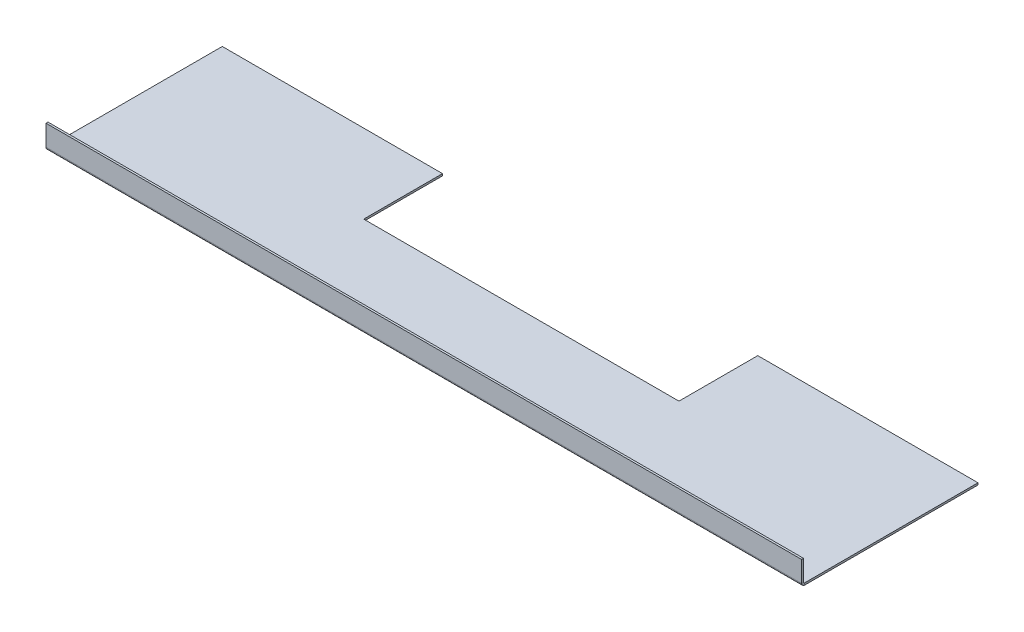
ISO-10303-21;
HEADER;
FILE_DESCRIPTION(('STEP AP214'),'2;1');
FILE_NAME('part.step','',(''),(''),'','','');
FILE_SCHEMA(('AUTOMOTIVE_DESIGN { 1 0 10303 214 1 1 1 1 }'));
ENDSEC;
DATA;
#1=APPLICATION_CONTEXT('core data for automotive mechanical design processes');
#2=APPLICATION_PROTOCOL_DEFINITION('international standard','automotive_design',2000,#1);
#3=PRODUCT_CONTEXT('',#1,'mechanical');
#4=PRODUCT('Part','Part','',(#3));
#5=PRODUCT_RELATED_PRODUCT_CATEGORY('part','',(#4));
#6=PRODUCT_DEFINITION_FORMATION('','',#4);
#7=PRODUCT_DEFINITION_CONTEXT('part definition',#1,'design');
#8=PRODUCT_DEFINITION('design','',#6,#7);
#9=PRODUCT_DEFINITION_SHAPE('','',#8);
#10=(LENGTH_UNIT() NAMED_UNIT(*) SI_UNIT(.MILLI.,.METRE.));
#11=(NAMED_UNIT(*) PLANE_ANGLE_UNIT() SI_UNIT($,.RADIAN.));
#12=(NAMED_UNIT(*) SI_UNIT($,.STERADIAN.) SOLID_ANGLE_UNIT());
#13=UNCERTAINTY_MEASURE_WITH_UNIT(LENGTH_MEASURE(1.E-05),#10,'distance_accuracy_value','');
#14=(GEOMETRIC_REPRESENTATION_CONTEXT(3) GLOBAL_UNCERTAINTY_ASSIGNED_CONTEXT((#13)) GLOBAL_UNIT_ASSIGNED_CONTEXT((#10,
#11,#12)) REPRESENTATION_CONTEXT('',''));
#15=CARTESIAN_POINT('',(0.,0.,0.));
#16=DIRECTION('',(0.,0.,1.));
#17=DIRECTION('',(1.,0.,0.));
#18=AXIS2_PLACEMENT_3D('',#15,#16,#17);
#19=CARTESIAN_POINT('',(304.419,-1.5875,-69.85));
#20=DIRECTION('',(1.,0.,0.));
#21=DIRECTION('',(0.,0.,-1.));
#22=AXIS2_PLACEMENT_3D('',#19,#20,#21);
#23=PLANE('',#22);
#24=DIRECTION('',(0.,0.,-1.));
#25=VECTOR('',#24,1.);
#26=CARTESIAN_POINT('',(304.419,0.,-69.85));
#27=LINE('',#26,#25);
#28=CARTESIAN_POINT('',(304.419,0.,69.85));
#29=VERTEX_POINT('',#28);
#30=CARTESIAN_POINT('',(304.419,0.,-69.85));
#31=VERTEX_POINT('',#30);
#32=EDGE_CURVE('E112',#29,#31,#27,.T.);
#33=ORIENTED_EDGE('',*,*,#32,.F.);
#34=DIRECTION('',(0.,1.,0.));
#35=VECTOR('',#34,1.);
#36=CARTESIAN_POINT('',(304.419,-1.5875,69.85));
#37=LINE('',#36,#35);
#38=CARTESIAN_POINT('',(304.419,-1.58749999999999,69.85));
#39=VERTEX_POINT('',#38);
#40=EDGE_CURVE('E13',#39,#29,#37,.T.);
#41=ORIENTED_EDGE('',*,*,#40,.F.);
#42=DIRECTION('',(0.,0.,-1.));
#43=VECTOR('',#42,1.);
#44=CARTESIAN_POINT('',(304.419,-1.5875,-69.85));
#45=LINE('',#44,#43);
#46=CARTESIAN_POINT('',(304.419,-1.5875,-69.85));
#47=VERTEX_POINT('',#46);
#48=EDGE_CURVE('E185',#39,#47,#45,.T.);
#49=ORIENTED_EDGE('',*,*,#48,.T.);
#50=DIRECTION('',(0.,1.,0.));
#51=VECTOR('',#50,1.);
#52=CARTESIAN_POINT('',(304.419,-1.5875,-69.85));
#53=LINE('',#52,#51);
#54=EDGE_CURVE('E64',#47,#31,#53,.T.);
#55=ORIENTED_EDGE('',*,*,#54,.T.);
#56=EDGE_LOOP('',(#33,#41,#49,#55));
#57=FACE_BOUND('',#56,.T.);
#58=ADVANCED_FACE('F61',(#57),#23,.T.);
#59=CARTESIAN_POINT('',(-304.419,-1.5875,-69.85));
#60=DIRECTION('',(-1.,0.,0.));
#61=DIRECTION('',(0.,0.,1.));
#62=AXIS2_PLACEMENT_3D('',#59,#60,#61);
#63=PLANE('',#62);
#64=DIRECTION('',(0.,0.,1.));
#65=VECTOR('',#64,1.);
#66=CARTESIAN_POINT('',(-304.419,0.,-69.85));
#67=LINE('',#66,#65);
#68=CARTESIAN_POINT('',(-304.419,0.,-69.85));
#69=VERTEX_POINT('',#68);
#70=CARTESIAN_POINT('',(-304.419,0.,69.85));
#71=VERTEX_POINT('',#70);
#72=EDGE_CURVE('E182',#69,#71,#67,.T.);
#73=ORIENTED_EDGE('',*,*,#72,.F.);
#74=DIRECTION('',(0.,1.,0.));
#75=VECTOR('',#74,1.);
#76=CARTESIAN_POINT('',(-304.419,-1.5875,-69.85));
#77=LINE('',#76,#75);
#78=CARTESIAN_POINT('',(-304.419,-1.5875,-69.85));
#79=VERTEX_POINT('',#78);
#80=EDGE_CURVE('E146',#79,#69,#77,.T.);
#81=ORIENTED_EDGE('',*,*,#80,.F.);
#82=DIRECTION('',(0.,0.,1.));
#83=VECTOR('',#82,1.);
#84=CARTESIAN_POINT('',(-304.419,-1.5875,-69.85));
#85=LINE('',#84,#83);
#86=CARTESIAN_POINT('',(-304.419,-1.5875,69.85));
#87=VERTEX_POINT('',#86);
#88=EDGE_CURVE('E79',#79,#87,#85,.T.);
#89=ORIENTED_EDGE('',*,*,#88,.T.);
#90=DIRECTION('',(0.,1.,0.));
#91=VECTOR('',#90,1.);
#92=CARTESIAN_POINT('',(-304.419,-1.5875,69.85));
#93=LINE('',#92,#91);
#94=EDGE_CURVE('E70',#87,#71,#93,.T.);
#95=ORIENTED_EDGE('',*,*,#94,.T.);
#96=EDGE_LOOP('',(#73,#81,#89,#95));
#97=FACE_BOUND('',#96,.T.);
#98=ADVANCED_FACE('F242',(#97),#63,.T.);
#99=CARTESIAN_POINT('',(-304.419,-1.5875,-69.85));
#100=DIRECTION('',(0.,0.,-1.));
#101=DIRECTION('',(-1.,0.,0.));
#102=AXIS2_PLACEMENT_3D('',#99,#100,#101);
#103=PLANE('',#102);
#104=DIRECTION('',(-1.,0.,0.));
#105=VECTOR('',#104,1.);
#106=CARTESIAN_POINT('',(-304.419,0.,-69.85));
#107=LINE('',#106,#105);
#108=CARTESIAN_POINT('',(-127.,0.,-69.85));
#109=VERTEX_POINT('',#108);
#110=EDGE_CURVE('E141',#109,#69,#107,.T.);
#111=ORIENTED_EDGE('',*,*,#110,.F.);
#112=DIRECTION('',(0.,1.,0.));
#113=VECTOR('',#112,1.);
#114=CARTESIAN_POINT('',(-127.,-1.5875,-69.85));
#115=LINE('',#114,#113);
#116=CARTESIAN_POINT('',(-127.,-1.5875,-69.85));
#117=VERTEX_POINT('',#116);
#118=EDGE_CURVE('E136',#117,#109,#115,.T.);
#119=ORIENTED_EDGE('',*,*,#118,.F.);
#120=DIRECTION('',(-1.,0.,0.));
#121=VECTOR('',#120,1.);
#122=CARTESIAN_POINT('',(-304.419,-1.5875,-69.85));
#123=LINE('',#122,#121);
#124=EDGE_CURVE('E139',#117,#79,#123,.T.);
#125=ORIENTED_EDGE('',*,*,#124,.T.);
#126=ORIENTED_EDGE('',*,*,#80,.T.);
#127=EDGE_LOOP('',(#111,#119,#125,#126));
#128=FACE_BOUND('',#127,.T.);
#129=ADVANCED_FACE('F138',(#128),#103,.T.);
#130=CARTESIAN_POINT('',(-127.,-1.5875,-69.85));
#131=DIRECTION('',(1.,0.,0.));
#132=DIRECTION('',(0.,0.,-1.));
#133=AXIS2_PLACEMENT_3D('',#130,#131,#132);
#134=PLANE('',#133);
#135=DIRECTION('',(0.,0.,-1.));
#136=VECTOR('',#135,1.);
#137=CARTESIAN_POINT('',(-127.,0.,-69.85));
#138=LINE('',#137,#136);
#139=CARTESIAN_POINT('',(-127.,0.,-6.35000000000004));
#140=VERTEX_POINT('',#139);
#141=EDGE_CURVE('E179',#140,#109,#138,.T.);
#142=ORIENTED_EDGE('',*,*,#141,.F.);
#143=DIRECTION('',(0.,1.,0.));
#144=VECTOR('',#143,1.);
#145=CARTESIAN_POINT('',(-127.,-1.5875,-6.35000000000004));
#146=LINE('',#145,#144);
#147=CARTESIAN_POINT('',(-127.,-1.5875,-6.35000000000004));
#148=VERTEX_POINT('',#147);
#149=EDGE_CURVE('E147',#148,#140,#146,.T.);
#150=ORIENTED_EDGE('',*,*,#149,.F.);
#151=DIRECTION('',(0.,0.,-1.));
#152=VECTOR('',#151,1.);
#153=CARTESIAN_POINT('',(-127.,-1.5875,-69.85));
#154=LINE('',#153,#152);
#155=EDGE_CURVE('E154',#148,#117,#154,.T.);
#156=ORIENTED_EDGE('',*,*,#155,.T.);
#157=ORIENTED_EDGE('',*,*,#118,.T.);
#158=EDGE_LOOP('',(#142,#150,#156,#157));
#159=FACE_BOUND('',#158,.T.);
#160=ADVANCED_FACE('F157',(#159),#134,.T.);
#161=CARTESIAN_POINT('',(-127.,-1.5875,-6.35000000000004));
#162=DIRECTION('',(0.,0.,-1.));
#163=DIRECTION('',(-1.,0.,0.));
#164=AXIS2_PLACEMENT_3D('',#161,#162,#163);
#165=PLANE('',#164);
#166=DIRECTION('',(-1.,0.,0.));
#167=VECTOR('',#166,1.);
#168=CARTESIAN_POINT('',(-127.,0.,-6.35000000000004));
#169=LINE('',#168,#167);
#170=CARTESIAN_POINT('',(127.,0.,-6.35000000000003));
#171=VERTEX_POINT('',#170);
#172=EDGE_CURVE('E176',#171,#140,#169,.T.);
#173=ORIENTED_EDGE('',*,*,#172,.F.);
#174=DIRECTION('',(0.,1.,0.));
#175=VECTOR('',#174,1.);
#176=CARTESIAN_POINT('',(127.,-1.5875,-6.35000000000003));
#177=LINE('',#176,#175);
#178=CARTESIAN_POINT('',(127.,-1.5875,-6.35000000000003));
#179=VERTEX_POINT('',#178);
#180=EDGE_CURVE('E190',#179,#171,#177,.T.);
#181=ORIENTED_EDGE('',*,*,#180,.F.);
#182=DIRECTION('',(-1.,0.,0.));
#183=VECTOR('',#182,1.);
#184=CARTESIAN_POINT('',(-127.,-1.5875,-6.35000000000004));
#185=LINE('',#184,#183);
#186=EDGE_CURVE('E158',#179,#148,#185,.T.);
#187=ORIENTED_EDGE('',*,*,#186,.T.);
#188=ORIENTED_EDGE('',*,*,#149,.T.);
#189=EDGE_LOOP('',(#173,#181,#187,#188));
#190=FACE_BOUND('',#189,.T.);
#191=ADVANCED_FACE('F232',(#190),#165,.T.);
#192=CARTESIAN_POINT('',(127.,-1.5875,-69.85));
#193=DIRECTION('',(-1.,0.,0.));
#194=DIRECTION('',(0.,0.,1.));
#195=AXIS2_PLACEMENT_3D('',#192,#193,#194);
#196=PLANE('',#195);
#197=DIRECTION('',(0.,0.,1.));
#198=VECTOR('',#197,1.);
#199=CARTESIAN_POINT('',(127.,0.,-69.85));
#200=LINE('',#199,#198);
#201=CARTESIAN_POINT('',(127.,0.,-69.85));
#202=VERTEX_POINT('',#201);
#203=EDGE_CURVE('E173',#202,#171,#200,.T.);
#204=ORIENTED_EDGE('',*,*,#203,.F.);
#205=DIRECTION('',(0.,1.,0.));
#206=VECTOR('',#205,1.);
#207=CARTESIAN_POINT('',(127.,-1.5875,-69.85));
#208=LINE('',#207,#206);
#209=CARTESIAN_POINT('',(127.,-1.5875,-69.85));
#210=VERTEX_POINT('',#209);
#211=EDGE_CURVE('E191',#210,#202,#208,.T.);
#212=ORIENTED_EDGE('',*,*,#211,.F.);
#213=DIRECTION('',(0.,0.,1.));
#214=VECTOR('',#213,1.);
#215=CARTESIAN_POINT('',(127.,-1.5875,-69.85));
#216=LINE('',#215,#214);
#217=EDGE_CURVE('E160',#210,#179,#216,.T.);
#218=ORIENTED_EDGE('',*,*,#217,.T.);
#219=ORIENTED_EDGE('',*,*,#180,.T.);
#220=EDGE_LOOP('',(#204,#212,#218,#219));
#221=FACE_BOUND('',#220,.T.);
#222=ADVANCED_FACE('F229',(#221),#196,.T.);
#223=CARTESIAN_POINT('',(127.,-1.5875,-69.85));
#224=DIRECTION('',(0.,0.,-1.));
#225=DIRECTION('',(-1.,0.,0.));
#226=AXIS2_PLACEMENT_3D('',#223,#224,#225);
#227=PLANE('',#226);
#228=DIRECTION('',(-1.,0.,0.));
#229=VECTOR('',#228,1.);
#230=CARTESIAN_POINT('',(127.,0.,-69.85));
#231=LINE('',#230,#229);
#232=EDGE_CURVE('E169',#31,#202,#231,.T.);
#233=ORIENTED_EDGE('',*,*,#232,.F.);
#234=ORIENTED_EDGE('',*,*,#54,.F.);
#235=DIRECTION('',(-1.,0.,0.));
#236=VECTOR('',#235,1.);
#237=CARTESIAN_POINT('',(127.,-1.5875,-69.85));
#238=LINE('',#237,#236);
#239=EDGE_CURVE('E225',#47,#210,#238,.T.);
#240=ORIENTED_EDGE('',*,*,#239,.T.);
#241=ORIENTED_EDGE('',*,*,#211,.T.);
#242=EDGE_LOOP('',(#233,#234,#240,#241));
#243=FACE_BOUND('',#242,.T.);
#244=ADVANCED_FACE('F194',(#243),#227,.T.);
#245=CARTESIAN_POINT('',(0.,-1.5875,0.));
#246=DIRECTION('',(0.,1.,0.));
#247=DIRECTION('',(0.,0.,1.));
#248=AXIS2_PLACEMENT_3D('',#245,#246,#247);
#249=PLANE('',#248);
#250=ORIENTED_EDGE('',*,*,#48,.F.);
#251=DIRECTION('',(1.,0.,0.));
#252=VECTOR('',#251,1.);
#253=CARTESIAN_POINT('',(-304.419,-1.5875,69.85));
#254=LINE('',#253,#252);
#255=EDGE_CURVE('E165',#87,#39,#254,.T.);
#256=ORIENTED_EDGE('',*,*,#255,.F.);
#257=ORIENTED_EDGE('',*,*,#88,.F.);
#258=ORIENTED_EDGE('',*,*,#124,.F.);
#259=ORIENTED_EDGE('',*,*,#155,.F.);
#260=ORIENTED_EDGE('',*,*,#186,.F.);
#261=ORIENTED_EDGE('',*,*,#217,.F.);
#262=ORIENTED_EDGE('',*,*,#239,.F.);
#263=EDGE_LOOP('',(#250,#256,#257,#258,#259,#260,#261,#262));
#264=FACE_BOUND('',#263,.T.);
#265=ADVANCED_FACE('F152',(#264),#249,.F.);
#266=CARTESIAN_POINT('',(0.,0.,0.));
#267=DIRECTION('',(0.,1.,0.));
#268=DIRECTION('',(0.,0.,1.));
#269=AXIS2_PLACEMENT_3D('',#266,#267,#268);
#270=PLANE('',#269);
#271=ORIENTED_EDGE('',*,*,#32,.T.);
#272=ORIENTED_EDGE('',*,*,#232,.T.);
#273=ORIENTED_EDGE('',*,*,#203,.T.);
#274=ORIENTED_EDGE('',*,*,#172,.T.);
#275=ORIENTED_EDGE('',*,*,#141,.T.);
#276=ORIENTED_EDGE('',*,*,#110,.T.);
#277=ORIENTED_EDGE('',*,*,#72,.T.);
#278=DIRECTION('',(1.,0.,0.));
#279=VECTOR('',#278,1.);
#280=CARTESIAN_POINT('',(-304.419,0.,69.85));
#281=LINE('',#280,#279);
#282=EDGE_CURVE('E184',#71,#29,#281,.T.);
#283=ORIENTED_EDGE('',*,*,#282,.T.);
#284=EDGE_LOOP('',(#271,#272,#273,#274,#275,#276,#277,#283));
#285=FACE_BOUND('',#284,.T.);
#286=ADVANCED_FACE('F196',(#285),#270,.T.);
#287=CARTESIAN_POINT('',(-304.419,0.736600000000011,69.85));
#288=DIRECTION('',(-1.,0.,0.));
#289=DIRECTION('',(0.,0.,1.));
#290=AXIS2_PLACEMENT_3D('',#287,#288,#289);
#291=PLANE('',#290);
#292=DIRECTION('',(0.,0.,-1.));
#293=VECTOR('',#292,1.);
#294=CARTESIAN_POINT('',(-304.419,0.736600000000004,72.1741));
#295=LINE('',#294,#293);
#296=CARTESIAN_POINT('',(-304.419,0.736600000000011,70.5866));
#297=VERTEX_POINT('',#296);
#298=CARTESIAN_POINT('',(-304.419,0.736600000000011,72.1741));
#299=VERTEX_POINT('',#298);
#300=EDGE_CURVE('E328',#297,#299,#295,.F.);
#301=ORIENTED_EDGE('',*,*,#300,.F.);
#302=CARTESIAN_POINT('',(-304.419,0.736600000000011,69.85));
#303=DIRECTION('',(1.,0.,0.));
#304=DIRECTION('',(0.,0.,-1.));
#305=AXIS2_PLACEMENT_3D('',#302,#303,#304);
#306=CIRCLE('',#305,0.736600000000004);
#307=EDGE_CURVE('E215',#71,#297,#306,.F.);
#308=ORIENTED_EDGE('',*,*,#307,.F.);
#309=ORIENTED_EDGE('',*,*,#94,.F.);
#310=CARTESIAN_POINT('',(-304.419,0.736600000000011,69.85));
#311=DIRECTION('',(1.,0.,0.));
#312=DIRECTION('',(0.,0.,-1.));
#313=AXIS2_PLACEMENT_3D('',#310,#311,#312);
#314=CIRCLE('',#313,2.3241);
#315=EDGE_CURVE('E170',#87,#299,#314,.F.);
#316=ORIENTED_EDGE('',*,*,#315,.T.);
#317=EDGE_LOOP('',(#301,#308,#309,#316));
#318=FACE_BOUND('',#317,.T.);
#319=ADVANCED_FACE('F254',(#318),#291,.T.);
#320=CARTESIAN_POINT('',(304.419,0.736600000000011,69.85));
#321=DIRECTION('',(-1.,0.,0.));
#322=DIRECTION('',(0.,0.,1.));
#323=AXIS2_PLACEMENT_3D('',#320,#321,#322);
#324=PLANE('',#323);
#325=CARTESIAN_POINT('',(304.419,0.736600000000011,69.85));
#326=DIRECTION('',(1.,0.,0.));
#327=DIRECTION('',(0.,0.,-1.));
#328=AXIS2_PLACEMENT_3D('',#325,#326,#327);
#329=CIRCLE('',#328,0.736600000000004);
#330=CARTESIAN_POINT('',(304.419,0.736600000000011,70.5866));
#331=VERTEX_POINT('',#330);
#332=EDGE_CURVE('E207',#331,#29,#329,.T.);
#333=ORIENTED_EDGE('',*,*,#332,.F.);
#334=DIRECTION('',(0.,0.,-1.));
#335=VECTOR('',#334,1.);
#336=CARTESIAN_POINT('',(304.419,0.736600000000018,70.5866));
#337=LINE('',#336,#335);
#338=CARTESIAN_POINT('',(304.419,0.736600000000018,72.1741));
#339=VERTEX_POINT('',#338);
#340=EDGE_CURVE('E308',#331,#339,#337,.F.);
#341=ORIENTED_EDGE('',*,*,#340,.T.);
#342=CARTESIAN_POINT('',(304.419,0.736600000000011,69.85));
#343=DIRECTION('',(1.,0.,0.));
#344=DIRECTION('',(0.,0.,-1.));
#345=AXIS2_PLACEMENT_3D('',#342,#343,#344);
#346=CIRCLE('',#345,2.3241);
#347=EDGE_CURVE('E210',#339,#39,#346,.T.);
#348=ORIENTED_EDGE('',*,*,#347,.T.);
#349=ORIENTED_EDGE('',*,*,#40,.T.);
#350=EDGE_LOOP('',(#333,#341,#348,#349));
#351=FACE_BOUND('',#350,.T.);
#352=ADVANCED_FACE('F205',(#351),#324,.F.);
#353=CARTESIAN_POINT('',(304.419,0.736600000000011,69.85));
#354=DIRECTION('',(1.,0.,0.));
#355=DIRECTION('',(0.,0.,1.));
#356=AXIS2_PLACEMENT_3D('',#353,#354,#355);
#357=CYLINDRICAL_SURFACE('',#356,2.3241);
#358=ORIENTED_EDGE('',*,*,#255,.T.);
#359=ORIENTED_EDGE('',*,*,#347,.F.);
#360=DIRECTION('',(1.,0.,0.));
#361=VECTOR('',#360,1.);
#362=CARTESIAN_POINT('',(-304.419,0.736600000000004,72.1741));
#363=LINE('',#362,#361);
#364=EDGE_CURVE('E294',#339,#299,#363,.F.);
#365=ORIENTED_EDGE('',*,*,#364,.T.);
#366=ORIENTED_EDGE('',*,*,#315,.F.);
#367=EDGE_LOOP('',(#358,#359,#365,#366));
#368=FACE_BOUND('',#367,.T.);
#369=ADVANCED_FACE('F259',(#368),#357,.T.);
#370=CARTESIAN_POINT('',(304.419,0.736600000000011,69.85));
#371=DIRECTION('',(1.,0.,0.));
#372=DIRECTION('',(0.,0.,1.));
#373=AXIS2_PLACEMENT_3D('',#370,#371,#372);
#374=CYLINDRICAL_SURFACE('',#373,0.736600000000004);
#375=ORIENTED_EDGE('',*,*,#282,.F.);
#376=ORIENTED_EDGE('',*,*,#307,.T.);
#377=DIRECTION('',(1.,0.,0.));
#378=VECTOR('',#377,1.);
#379=CARTESIAN_POINT('',(-304.419,0.736600000000004,70.5866));
#380=LINE('',#379,#378);
#381=EDGE_CURVE('E214',#297,#331,#380,.T.);
#382=ORIENTED_EDGE('',*,*,#381,.T.);
#383=ORIENTED_EDGE('',*,*,#332,.T.);
#384=EDGE_LOOP('',(#375,#376,#382,#383));
#385=FACE_BOUND('',#384,.T.);
#386=ADVANCED_FACE('F212',(#385),#374,.F.);
#387=CARTESIAN_POINT('',(-304.419,0.,72.1741));
#388=DIRECTION('',(1.,0.,0.));
#389=DIRECTION('',(0.,0.,-1.));
#390=AXIS2_PLACEMENT_3D('',#387,#388,#389);
#391=PLANE('',#390);
#392=ORIENTED_EDGE('',*,*,#300,.T.);
#393=DIRECTION('',(0.,-1.,0.));
#394=VECTOR('',#393,1.);
#395=CARTESIAN_POINT('',(-304.419,0.,72.1741));
#396=LINE('',#395,#394);
#397=CARTESIAN_POINT('',(-304.419,17.4625,72.1741));
#398=VERTEX_POINT('',#397);
#399=EDGE_CURVE('E302',#398,#299,#396,.T.);
#400=ORIENTED_EDGE('',*,*,#399,.F.);
#401=DIRECTION('',(0.,0.,-1.));
#402=VECTOR('',#401,1.);
#403=CARTESIAN_POINT('',(-304.419,17.4625,72.1741));
#404=LINE('',#403,#402);
#405=CARTESIAN_POINT('',(-304.419,17.4625,70.5866));
#406=VERTEX_POINT('',#405);
#407=EDGE_CURVE('E220',#398,#406,#404,.T.);
#408=ORIENTED_EDGE('',*,*,#407,.T.);
#409=DIRECTION('',(0.,1.,0.));
#410=VECTOR('',#409,1.);
#411=CARTESIAN_POINT('',(-304.419,0.,70.5866));
#412=LINE('',#411,#410);
#413=EDGE_CURVE('E307',#406,#297,#412,.F.);
#414=ORIENTED_EDGE('',*,*,#413,.T.);
#415=EDGE_LOOP('',(#392,#400,#408,#414));
#416=FACE_BOUND('',#415,.T.);
#417=ADVANCED_FACE('F265',(#416),#391,.F.);
#418=CARTESIAN_POINT('',(304.419,17.4625,72.1741));
#419=DIRECTION('',(-1.,0.,0.));
#420=DIRECTION('',(0.,0.,1.));
#421=AXIS2_PLACEMENT_3D('',#418,#419,#420);
#422=PLANE('',#421);
#423=ORIENTED_EDGE('',*,*,#340,.F.);
#424=DIRECTION('',(0.,-1.,0.));
#425=VECTOR('',#424,1.);
#426=CARTESIAN_POINT('',(304.419,17.4625,70.5866));
#427=LINE('',#426,#425);
#428=CARTESIAN_POINT('',(304.419,17.4625,70.5866));
#429=VERTEX_POINT('',#428);
#430=EDGE_CURVE('E322',#331,#429,#427,.F.);
#431=ORIENTED_EDGE('',*,*,#430,.T.);
#432=DIRECTION('',(0.,0.,-1.));
#433=VECTOR('',#432,1.);
#434=CARTESIAN_POINT('',(304.419,17.4625,72.1741));
#435=LINE('',#434,#433);
#436=CARTESIAN_POINT('',(304.419,17.4625,72.1741));
#437=VERTEX_POINT('',#436);
#438=EDGE_CURVE('E216',#437,#429,#435,.T.);
#439=ORIENTED_EDGE('',*,*,#438,.F.);
#440=DIRECTION('',(0.,1.,0.));
#441=VECTOR('',#440,1.);
#442=CARTESIAN_POINT('',(304.419,0.,72.1741));
#443=LINE('',#442,#441);
#444=EDGE_CURVE('E298',#339,#437,#443,.T.);
#445=ORIENTED_EDGE('',*,*,#444,.F.);
#446=EDGE_LOOP('',(#423,#431,#439,#445));
#447=FACE_BOUND('',#446,.T.);
#448=ADVANCED_FACE('F271',(#447),#422,.F.);
#449=CARTESIAN_POINT('',(0.,0.,72.1741));
#450=DIRECTION('',(0.,0.,-1.));
#451=DIRECTION('',(-1.,0.,0.));
#452=AXIS2_PLACEMENT_3D('',#449,#450,#451);
#453=PLANE('',#452);
#454=ORIENTED_EDGE('',*,*,#364,.F.);
#455=ORIENTED_EDGE('',*,*,#444,.T.);
#456=DIRECTION('',(-1.,0.,0.));
#457=VECTOR('',#456,1.);
#458=CARTESIAN_POINT('',(0.,17.4625,72.1741));
#459=LINE('',#458,#457);
#460=EDGE_CURVE('E313',#437,#398,#459,.T.);
#461=ORIENTED_EDGE('',*,*,#460,.T.);
#462=ORIENTED_EDGE('',*,*,#399,.T.);
#463=EDGE_LOOP('',(#454,#455,#461,#462));
#464=FACE_BOUND('',#463,.T.);
#465=ADVANCED_FACE('F275',(#464),#453,.F.);
#466=CARTESIAN_POINT('',(0.,0.,70.5866));
#467=DIRECTION('',(0.,0.,-1.));
#468=DIRECTION('',(-1.,0.,0.));
#469=AXIS2_PLACEMENT_3D('',#466,#467,#468);
#470=PLANE('',#469);
#471=ORIENTED_EDGE('',*,*,#430,.F.);
#472=ORIENTED_EDGE('',*,*,#381,.F.);
#473=ORIENTED_EDGE('',*,*,#413,.F.);
#474=DIRECTION('',(1.,0.,0.));
#475=VECTOR('',#474,1.);
#476=CARTESIAN_POINT('',(-304.419,17.4625,70.5866));
#477=LINE('',#476,#475);
#478=EDGE_CURVE('E316',#429,#406,#477,.F.);
#479=ORIENTED_EDGE('',*,*,#478,.F.);
#480=EDGE_LOOP('',(#471,#472,#473,#479));
#481=FACE_BOUND('',#480,.T.);
#482=ADVANCED_FACE('F280',(#481),#470,.T.);
#483=CARTESIAN_POINT('',(-304.419,17.4625,72.1741));
#484=DIRECTION('',(0.,-1.,0.));
#485=DIRECTION('',(0.,0.,-1.));
#486=AXIS2_PLACEMENT_3D('',#483,#484,#485);
#487=PLANE('',#486);
#488=ORIENTED_EDGE('',*,*,#478,.T.);
#489=ORIENTED_EDGE('',*,*,#407,.F.);
#490=ORIENTED_EDGE('',*,*,#460,.F.);
#491=ORIENTED_EDGE('',*,*,#438,.T.);
#492=EDGE_LOOP('',(#488,#489,#490,#491));
#493=FACE_BOUND('',#492,.T.);
#494=ADVANCED_FACE('F277',(#493),#487,.F.);
#495=CLOSED_SHELL('',(#58,#98,#129,#160,#191,#222,#244,#265,#286,#319,#352,#369,#386,#417,#448,
#465,#482,#494));
#496=MANIFOLD_SOLID_BREP('B2',#495);
#497=ADVANCED_BREP_SHAPE_REPRESENTATION('',(#18,#496),#14);
#498=SHAPE_DEFINITION_REPRESENTATION(#9,#497);
ENDSEC;
END-ISO-10303-21;
